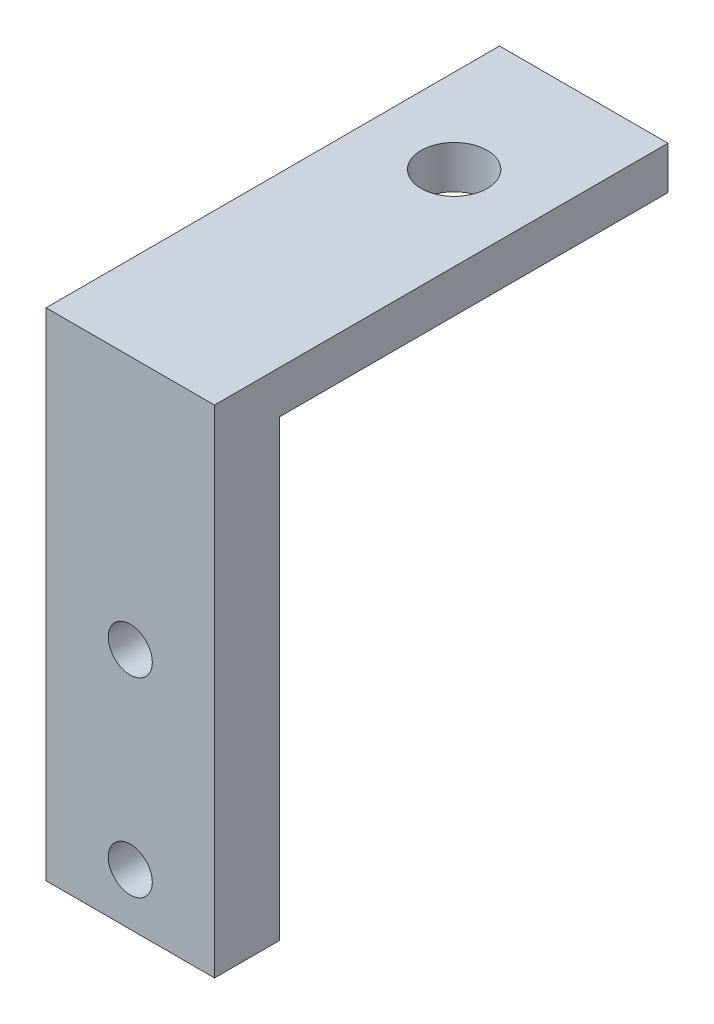
ISO-10303-21;
HEADER;
FILE_DESCRIPTION(('STEP AP214'),'2;1');
FILE_NAME('part.step','',(''),(''),'','','');
FILE_SCHEMA(('AUTOMOTIVE_DESIGN { 1 0 10303 214 1 1 1 1 }'));
ENDSEC;
DATA;
#1=APPLICATION_CONTEXT('core data for automotive mechanical design processes');
#2=APPLICATION_PROTOCOL_DEFINITION('international standard','automotive_design',2000,#1);
#3=PRODUCT_CONTEXT('',#1,'mechanical');
#4=PRODUCT('Part','Part','',(#3));
#5=PRODUCT_RELATED_PRODUCT_CATEGORY('part','',(#4));
#6=PRODUCT_DEFINITION_FORMATION('','',#4);
#7=PRODUCT_DEFINITION_CONTEXT('part definition',#1,'design');
#8=PRODUCT_DEFINITION('design','',#6,#7);
#9=PRODUCT_DEFINITION_SHAPE('','',#8);
#10=(LENGTH_UNIT() NAMED_UNIT(*) SI_UNIT(.MILLI.,.METRE.));
#11=(NAMED_UNIT(*) PLANE_ANGLE_UNIT() SI_UNIT($,.RADIAN.));
#12=(NAMED_UNIT(*) SI_UNIT($,.STERADIAN.) SOLID_ANGLE_UNIT());
#13=UNCERTAINTY_MEASURE_WITH_UNIT(LENGTH_MEASURE(1.E-05),#10,'distance_accuracy_value','');
#14=(GEOMETRIC_REPRESENTATION_CONTEXT(3) GLOBAL_UNCERTAINTY_ASSIGNED_CONTEXT((#13)) GLOBAL_UNIT_ASSIGNED_CONTEXT((#10,
#11,#12)) REPRESENTATION_CONTEXT('',''));
#15=CARTESIAN_POINT('',(0.,0.,0.));
#16=DIRECTION('',(0.,0.,1.));
#17=DIRECTION('',(1.,0.,0.));
#18=AXIS2_PLACEMENT_3D('',#15,#16,#17);
#19=CARTESIAN_POINT('',(13.,0.,-5.));
#20=DIRECTION('',(0.,1.,0.));
#21=DIRECTION('',(0.,0.,1.));
#22=AXIS2_PLACEMENT_3D('',#19,#20,#21);
#23=PLANE('',#22);
#24=DIRECTION('',(0.,0.,-1.));
#25=VECTOR('',#24,1.);
#26=CARTESIAN_POINT('',(0.,0.,-5.));
#27=LINE('',#26,#25);
#28=CARTESIAN_POINT('',(0.,0.,0.));
#29=VERTEX_POINT('',#28);
#30=CARTESIAN_POINT('',(0.,0.,-5.));
#31=VERTEX_POINT('',#30);
#32=EDGE_CURVE('E121',#29,#31,#27,.T.);
#33=ORIENTED_EDGE('',*,*,#32,.T.);
#34=DIRECTION('',(-1.,0.,0.));
#35=VECTOR('',#34,1.);
#36=CARTESIAN_POINT('',(13.,0.,-5.));
#37=LINE('',#36,#35);
#38=CARTESIAN_POINT('',(13.,0.,-5.));
#39=VERTEX_POINT('',#38);
#40=EDGE_CURVE('E11',#39,#31,#37,.T.);
#41=ORIENTED_EDGE('',*,*,#40,.F.);
#42=DIRECTION('',(0.,0.,-1.));
#43=VECTOR('',#42,1.);
#44=CARTESIAN_POINT('',(13.,0.,-5.));
#45=LINE('',#44,#43);
#46=CARTESIAN_POINT('',(13.,0.,0.));
#47=VERTEX_POINT('',#46);
#48=EDGE_CURVE('E132',#47,#39,#45,.T.);
#49=ORIENTED_EDGE('',*,*,#48,.F.);
#50=DIRECTION('',(-1.,0.,0.));
#51=VECTOR('',#50,1.);
#52=CARTESIAN_POINT('',(13.,0.,0.));
#53=LINE('',#52,#51);
#54=EDGE_CURVE('E117',#47,#29,#53,.T.);
#55=ORIENTED_EDGE('',*,*,#54,.T.);
#56=EDGE_LOOP('',(#33,#41,#49,#55));
#57=FACE_BOUND('',#56,.T.);
#58=ADVANCED_FACE('F37',(#57),#23,.F.);
#59=CARTESIAN_POINT('',(13.,35.,-5.));
#60=DIRECTION('',(0.,0.,1.));
#61=DIRECTION('',(0.,-1.,0.));
#62=AXIS2_PLACEMENT_3D('',#59,#60,#61);
#63=PLANE('',#62);
#64=CARTESIAN_POINT('',(6.5,18.7,-5.));
#65=DIRECTION('',(0.,0.,-1.));
#66=DIRECTION('',(0.,1.,0.));
#67=AXIS2_PLACEMENT_3D('',#64,#65,#66);
#68=CIRCLE('',#67,1.7);
#69=CARTESIAN_POINT('',(6.5,20.4,-5.));
#70=VERTEX_POINT('',#69);
#71=EDGE_CURVE('E276',#70,#70,#68,.T.);
#72=ORIENTED_EDGE('',*,*,#71,.F.);
#73=EDGE_LOOP('',(#72));
#74=FACE_BOUND('',#73,.T.);
#75=CARTESIAN_POINT('',(6.5,4.,-5.));
#76=DIRECTION('',(0.,0.,-1.));
#77=DIRECTION('',(0.,1.,0.));
#78=AXIS2_PLACEMENT_3D('',#75,#76,#77);
#79=CIRCLE('',#78,1.7);
#80=CARTESIAN_POINT('',(6.5,5.7,-5.));
#81=VERTEX_POINT('',#80);
#82=EDGE_CURVE('E275',#81,#81,#79,.T.);
#83=ORIENTED_EDGE('',*,*,#82,.F.);
#84=EDGE_LOOP('',(#83));
#85=FACE_BOUND('',#84,.T.);
#86=DIRECTION('',(0.,1.,0.));
#87=VECTOR('',#86,1.);
#88=CARTESIAN_POINT('',(0.,35.,-5.));
#89=LINE('',#88,#87);
#90=CARTESIAN_POINT('',(0.,35.,-5.));
#91=VERTEX_POINT('',#90);
#92=EDGE_CURVE('E124',#31,#91,#89,.T.);
#93=ORIENTED_EDGE('',*,*,#92,.T.);
#94=DIRECTION('',(-1.,0.,0.));
#95=VECTOR('',#94,1.);
#96=CARTESIAN_POINT('',(13.,35.,-5.));
#97=LINE('',#96,#95);
#98=CARTESIAN_POINT('',(13.,35.,-5.));
#99=VERTEX_POINT('',#98);
#100=EDGE_CURVE('E45',#99,#91,#97,.T.);
#101=ORIENTED_EDGE('',*,*,#100,.F.);
#102=DIRECTION('',(0.,1.,0.));
#103=VECTOR('',#102,1.);
#104=CARTESIAN_POINT('',(13.,35.,-5.));
#105=LINE('',#104,#103);
#106=EDGE_CURVE('E90',#39,#99,#105,.T.);
#107=ORIENTED_EDGE('',*,*,#106,.F.);
#108=ORIENTED_EDGE('',*,*,#40,.T.);
#109=EDGE_LOOP('',(#93,#101,#107,#108));
#110=FACE_BOUND('',#109,.T.);
#111=ADVANCED_FACE('F160',(#74,#85,#110),#63,.F.);
#112=CARTESIAN_POINT('',(13.,35.,-35.));
#113=DIRECTION('',(0.,1.,0.));
#114=DIRECTION('',(0.,0.,1.));
#115=AXIS2_PLACEMENT_3D('',#112,#113,#114);
#116=PLANE('',#115);
#117=CARTESIAN_POINT('',(6.5,35.,-25.));
#118=DIRECTION('',(0.,1.,0.));
#119=DIRECTION('',(0.,0.,1.));
#120=AXIS2_PLACEMENT_3D('',#117,#118,#119);
#121=CIRCLE('',#120,2.55);
#122=CARTESIAN_POINT('',(6.5,35.,-22.45));
#123=VERTEX_POINT('',#122);
#124=EDGE_CURVE('E280',#123,#123,#121,.T.);
#125=ORIENTED_EDGE('',*,*,#124,.T.);
#126=EDGE_LOOP('',(#125));
#127=FACE_BOUND('',#126,.T.);
#128=DIRECTION('',(0.,0.,-1.));
#129=VECTOR('',#128,1.);
#130=CARTESIAN_POINT('',(0.,35.,-35.));
#131=LINE('',#130,#129);
#132=CARTESIAN_POINT('',(0.,35.,-35.));
#133=VERTEX_POINT('',#132);
#134=EDGE_CURVE('E127',#91,#133,#131,.T.);
#135=ORIENTED_EDGE('',*,*,#134,.T.);
#136=DIRECTION('',(-1.,0.,0.));
#137=VECTOR('',#136,1.);
#138=CARTESIAN_POINT('',(13.,35.,-35.));
#139=LINE('',#138,#137);
#140=CARTESIAN_POINT('',(13.,35.,-35.));
#141=VERTEX_POINT('',#140);
#142=EDGE_CURVE('E112',#141,#133,#139,.T.);
#143=ORIENTED_EDGE('',*,*,#142,.F.);
#144=DIRECTION('',(0.,0.,-1.));
#145=VECTOR('',#144,1.);
#146=CARTESIAN_POINT('',(13.,35.,-35.));
#147=LINE('',#146,#145);
#148=EDGE_CURVE('E103',#99,#141,#147,.T.);
#149=ORIENTED_EDGE('',*,*,#148,.F.);
#150=ORIENTED_EDGE('',*,*,#100,.T.);
#151=EDGE_LOOP('',(#135,#143,#149,#150));
#152=FACE_BOUND('',#151,.T.);
#153=ADVANCED_FACE('F138',(#127,#152),#116,.F.);
#154=CARTESIAN_POINT('',(13.,38.3,-35.));
#155=DIRECTION('',(0.,0.,1.));
#156=DIRECTION('',(0.,-1.,0.));
#157=AXIS2_PLACEMENT_3D('',#154,#155,#156);
#158=PLANE('',#157);
#159=DIRECTION('',(0.,1.,0.));
#160=VECTOR('',#159,1.);
#161=CARTESIAN_POINT('',(0.,38.3,-35.));
#162=LINE('',#161,#160);
#163=CARTESIAN_POINT('',(0.,38.3,-35.));
#164=VERTEX_POINT('',#163);
#165=EDGE_CURVE('E111',#133,#164,#162,.T.);
#166=ORIENTED_EDGE('',*,*,#165,.T.);
#167=DIRECTION('',(-1.,0.,0.));
#168=VECTOR('',#167,1.);
#169=CARTESIAN_POINT('',(13.,38.3,-35.));
#170=LINE('',#169,#168);
#171=CARTESIAN_POINT('',(13.,38.3,-35.));
#172=VERTEX_POINT('',#171);
#173=EDGE_CURVE('E108',#172,#164,#170,.T.);
#174=ORIENTED_EDGE('',*,*,#173,.F.);
#175=DIRECTION('',(0.,1.,0.));
#176=VECTOR('',#175,1.);
#177=CARTESIAN_POINT('',(13.,38.3,-35.));
#178=LINE('',#177,#176);
#179=EDGE_CURVE('E97',#141,#172,#178,.T.);
#180=ORIENTED_EDGE('',*,*,#179,.F.);
#181=ORIENTED_EDGE('',*,*,#142,.T.);
#182=EDGE_LOOP('',(#166,#174,#180,#181));
#183=FACE_BOUND('',#182,.T.);
#184=ADVANCED_FACE('F109',(#183),#158,.F.);
#185=CARTESIAN_POINT('',(13.,38.3,0.));
#186=DIRECTION('',(0.,-1.,0.));
#187=DIRECTION('',(0.,0.,-1.));
#188=AXIS2_PLACEMENT_3D('',#185,#186,#187);
#189=PLANE('',#188);
#190=CARTESIAN_POINT('',(6.5,38.3,-25.));
#191=DIRECTION('',(0.,1.,0.));
#192=DIRECTION('',(0.,0.,1.));
#193=AXIS2_PLACEMENT_3D('',#190,#191,#192);
#194=CIRCLE('',#193,2.55);
#195=CARTESIAN_POINT('',(6.5,38.3,-22.45));
#196=VERTEX_POINT('',#195);
#197=EDGE_CURVE('E288',#196,#196,#194,.T.);
#198=ORIENTED_EDGE('',*,*,#197,.F.);
#199=EDGE_LOOP('',(#198));
#200=FACE_BOUND('',#199,.T.);
#201=DIRECTION('',(0.,0.,1.));
#202=VECTOR('',#201,1.);
#203=CARTESIAN_POINT('',(0.,38.3,0.));
#204=LINE('',#203,#202);
#205=CARTESIAN_POINT('',(0.,38.3,0.));
#206=VERTEX_POINT('',#205);
#207=EDGE_CURVE('E76',#164,#206,#204,.T.);
#208=ORIENTED_EDGE('',*,*,#207,.T.);
#209=DIRECTION('',(-1.,0.,0.));
#210=VECTOR('',#209,1.);
#211=CARTESIAN_POINT('',(13.,38.3,0.));
#212=LINE('',#211,#210);
#213=CARTESIAN_POINT('',(13.,38.3,0.));
#214=VERTEX_POINT('',#213);
#215=EDGE_CURVE('E113',#214,#206,#212,.T.);
#216=ORIENTED_EDGE('',*,*,#215,.F.);
#217=DIRECTION('',(0.,0.,1.));
#218=VECTOR('',#217,1.);
#219=CARTESIAN_POINT('',(13.,38.3,0.));
#220=LINE('',#219,#218);
#221=EDGE_CURVE('E101',#172,#214,#220,.T.);
#222=ORIENTED_EDGE('',*,*,#221,.F.);
#223=ORIENTED_EDGE('',*,*,#173,.T.);
#224=EDGE_LOOP('',(#208,#216,#222,#223));
#225=FACE_BOUND('',#224,.T.);
#226=ADVANCED_FACE('F115',(#200,#225),#189,.F.);
#227=CARTESIAN_POINT('',(13.,0.,0.));
#228=DIRECTION('',(0.,0.,-1.));
#229=DIRECTION('',(-1.,0.,0.));
#230=AXIS2_PLACEMENT_3D('',#227,#228,#229);
#231=PLANE('',#230);
#232=CARTESIAN_POINT('',(6.5,18.7,0.));
#233=DIRECTION('',(0.,0.,-1.));
#234=DIRECTION('',(0.,1.,0.));
#235=AXIS2_PLACEMENT_3D('',#232,#233,#234);
#236=CIRCLE('',#235,1.7);
#237=CARTESIAN_POINT('',(6.5,20.4,0.));
#238=VERTEX_POINT('',#237);
#239=EDGE_CURVE('E125',#238,#238,#236,.T.);
#240=ORIENTED_EDGE('',*,*,#239,.T.);
#241=EDGE_LOOP('',(#240));
#242=FACE_BOUND('',#241,.T.);
#243=CARTESIAN_POINT('',(6.5,4.,0.));
#244=DIRECTION('',(0.,0.,-1.));
#245=DIRECTION('',(0.,1.,0.));
#246=AXIS2_PLACEMENT_3D('',#243,#244,#245);
#247=CIRCLE('',#246,1.7);
#248=CARTESIAN_POINT('',(6.5,5.7,0.));
#249=VERTEX_POINT('',#248);
#250=EDGE_CURVE('E272',#249,#249,#247,.T.);
#251=ORIENTED_EDGE('',*,*,#250,.T.);
#252=EDGE_LOOP('',(#251));
#253=FACE_BOUND('',#252,.T.);
#254=DIRECTION('',(0.,-1.,0.));
#255=VECTOR('',#254,1.);
#256=CARTESIAN_POINT('',(0.,0.,0.));
#257=LINE('',#256,#255);
#258=EDGE_CURVE('E82',#206,#29,#257,.T.);
#259=ORIENTED_EDGE('',*,*,#258,.T.);
#260=ORIENTED_EDGE('',*,*,#54,.F.);
#261=DIRECTION('',(0.,-1.,0.));
#262=VECTOR('',#261,1.);
#263=CARTESIAN_POINT('',(13.,0.,0.));
#264=LINE('',#263,#262);
#265=EDGE_CURVE('E53',#214,#47,#264,.T.);
#266=ORIENTED_EDGE('',*,*,#265,.F.);
#267=ORIENTED_EDGE('',*,*,#215,.T.);
#268=EDGE_LOOP('',(#259,#260,#266,#267));
#269=FACE_BOUND('',#268,.T.);
#270=ADVANCED_FACE('F145',(#242,#253,#269),#231,.F.);
#271=CARTESIAN_POINT('',(13.,0.,0.));
#272=DIRECTION('',(-1.,0.,0.));
#273=DIRECTION('',(0.,0.,1.));
#274=AXIS2_PLACEMENT_3D('',#271,#272,#273);
#275=PLANE('',#274);
#276=ORIENTED_EDGE('',*,*,#48,.T.);
#277=ORIENTED_EDGE('',*,*,#106,.T.);
#278=ORIENTED_EDGE('',*,*,#148,.T.);
#279=ORIENTED_EDGE('',*,*,#179,.T.);
#280=ORIENTED_EDGE('',*,*,#221,.T.);
#281=ORIENTED_EDGE('',*,*,#265,.T.);
#282=EDGE_LOOP('',(#276,#277,#278,#279,#280,#281));
#283=FACE_BOUND('',#282,.T.);
#284=ADVANCED_FACE('F99',(#283),#275,.F.);
#285=CARTESIAN_POINT('',(0.,0.,0.));
#286=DIRECTION('',(-1.,0.,0.));
#287=DIRECTION('',(0.,0.,1.));
#288=AXIS2_PLACEMENT_3D('',#285,#286,#287);
#289=PLANE('',#288);
#290=ORIENTED_EDGE('',*,*,#32,.F.);
#291=ORIENTED_EDGE('',*,*,#258,.F.);
#292=ORIENTED_EDGE('',*,*,#207,.F.);
#293=ORIENTED_EDGE('',*,*,#165,.F.);
#294=ORIENTED_EDGE('',*,*,#134,.F.);
#295=ORIENTED_EDGE('',*,*,#92,.F.);
#296=EDGE_LOOP('',(#290,#291,#292,#293,#294,#295));
#297=FACE_BOUND('',#296,.T.);
#298=ADVANCED_FACE('F141',(#297),#289,.T.);
#299=CARTESIAN_POINT('',(6.5,4.,0.));
#300=DIRECTION('',(0.,0.,-1.));
#301=DIRECTION('',(0.,1.,0.));
#302=AXIS2_PLACEMENT_3D('',#299,#300,#301);
#303=CYLINDRICAL_SURFACE('',#302,1.7);
#304=ORIENTED_EDGE('',*,*,#250,.F.);
#305=EDGE_LOOP('',(#304));
#306=FACE_BOUND('',#305,.T.);
#307=ORIENTED_EDGE('',*,*,#82,.T.);
#308=EDGE_LOOP('',(#307));
#309=FACE_BOUND('',#308,.T.);
#310=ADVANCED_FACE('F208',(#306,#309),#303,.F.);
#311=CARTESIAN_POINT('',(6.5,18.7,0.));
#312=DIRECTION('',(0.,0.,-1.));
#313=DIRECTION('',(0.,1.,0.));
#314=AXIS2_PLACEMENT_3D('',#311,#312,#313);
#315=CYLINDRICAL_SURFACE('',#314,1.7);
#316=ORIENTED_EDGE('',*,*,#239,.F.);
#317=EDGE_LOOP('',(#316));
#318=FACE_BOUND('',#317,.T.);
#319=ORIENTED_EDGE('',*,*,#71,.T.);
#320=EDGE_LOOP('',(#319));
#321=FACE_BOUND('',#320,.T.);
#322=ADVANCED_FACE('F197',(#318,#321),#315,.F.);
#323=CARTESIAN_POINT('',(6.5,0.,-25.));
#324=DIRECTION('',(0.,1.,0.));
#325=DIRECTION('',(0.,0.,1.));
#326=AXIS2_PLACEMENT_3D('',#323,#324,#325);
#327=CYLINDRICAL_SURFACE('',#326,2.55);
#328=ORIENTED_EDGE('',*,*,#197,.T.);
#329=EDGE_LOOP('',(#328));
#330=FACE_BOUND('',#329,.T.);
#331=ORIENTED_EDGE('',*,*,#124,.F.);
#332=EDGE_LOOP('',(#331));
#333=FACE_BOUND('',#332,.T.);
#334=ADVANCED_FACE('F193',(#330,#333),#327,.F.);
#335=CLOSED_SHELL('',(#58,#111,#153,#184,#226,#270,#284,#298,#310,#322,#334));
#336=MANIFOLD_SOLID_BREP('B2',#335);
#337=ADVANCED_BREP_SHAPE_REPRESENTATION('',(#18,#336),#14);
#338=SHAPE_DEFINITION_REPRESENTATION(#9,#337);
ENDSEC;
END-ISO-10303-21;
